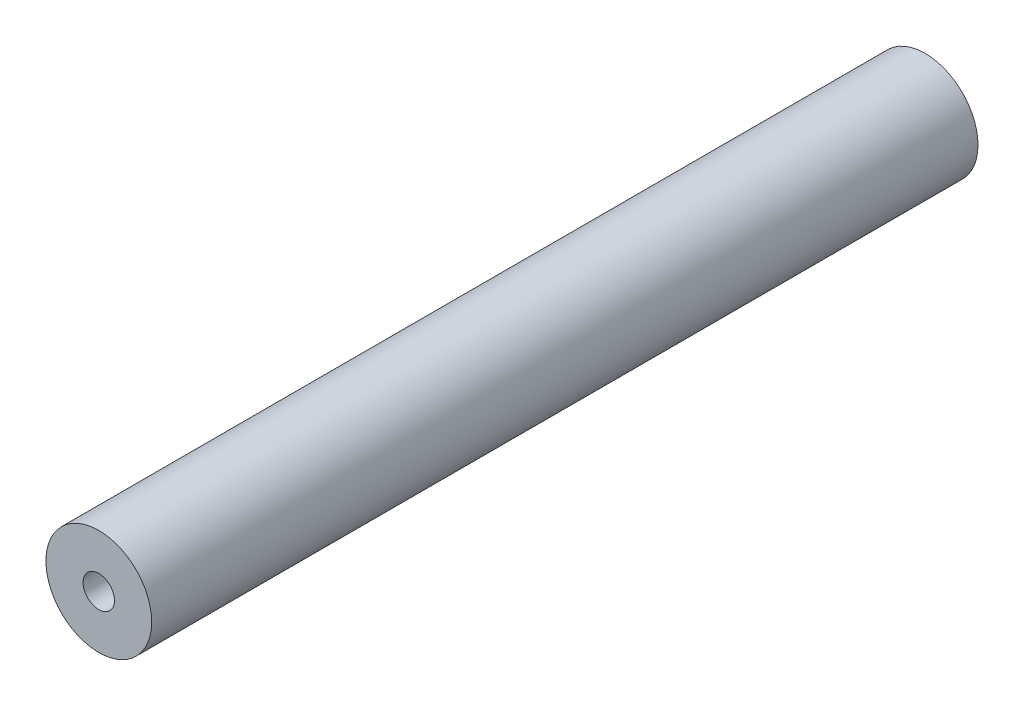
ISO-10303-21;
HEADER;
FILE_DESCRIPTION(('STEP AP214'),'2;1');
FILE_NAME('part.step','',(''),(''),'','','');
FILE_SCHEMA(('AUTOMOTIVE_DESIGN { 1 0 10303 214 1 1 1 1 }'));
ENDSEC;
DATA;
#1=APPLICATION_CONTEXT('core data for automotive mechanical design processes');
#2=APPLICATION_PROTOCOL_DEFINITION('international standard','automotive_design',2000,#1);
#3=PRODUCT_CONTEXT('',#1,'mechanical');
#4=PRODUCT('Part','Part','',(#3));
#5=PRODUCT_RELATED_PRODUCT_CATEGORY('part','',(#4));
#6=PRODUCT_DEFINITION_FORMATION('','',#4);
#7=PRODUCT_DEFINITION_CONTEXT('part definition',#1,'design');
#8=PRODUCT_DEFINITION('design','',#6,#7);
#9=PRODUCT_DEFINITION_SHAPE('','',#8);
#10=(LENGTH_UNIT() NAMED_UNIT(*) SI_UNIT(.MILLI.,.METRE.));
#11=(NAMED_UNIT(*) PLANE_ANGLE_UNIT() SI_UNIT($,.RADIAN.));
#12=(NAMED_UNIT(*) SI_UNIT($,.STERADIAN.) SOLID_ANGLE_UNIT());
#13=UNCERTAINTY_MEASURE_WITH_UNIT(LENGTH_MEASURE(1.E-05),#10,'distance_accuracy_value','');
#14=(GEOMETRIC_REPRESENTATION_CONTEXT(3) GLOBAL_UNCERTAINTY_ASSIGNED_CONTEXT((#13)) GLOBAL_UNIT_ASSIGNED_CONTEXT((#10,
#11,#12)) REPRESENTATION_CONTEXT('',''));
#15=CARTESIAN_POINT('',(0.,0.,0.));
#16=DIRECTION('',(0.,0.,1.));
#17=DIRECTION('',(1.,0.,0.));
#18=AXIS2_PLACEMENT_3D('',#15,#16,#17);
#19=CARTESIAN_POINT('',(0.,0.,100.));
#20=DIRECTION('',(0.,0.,-1.));
#21=DIRECTION('',(-1.,0.,0.));
#22=AXIS2_PLACEMENT_3D('',#19,#20,#21);
#23=CYLINDRICAL_SURFACE('',#22,6.4);
#24=CARTESIAN_POINT('',(0.,0.,100.));
#25=DIRECTION('',(0.,0.,1.));
#26=DIRECTION('',(1.,0.,0.));
#27=AXIS2_PLACEMENT_3D('',#24,#25,#26);
#28=CIRCLE('',#27,6.4);
#29=CARTESIAN_POINT('',(6.4,0.,100.));
#30=VERTEX_POINT('',#29);
#31=EDGE_CURVE('E11',#30,#30,#28,.T.);
#32=ORIENTED_EDGE('',*,*,#31,.F.);
#33=EDGE_LOOP('',(#32));
#34=FACE_BOUND('',#33,.T.);
#35=CARTESIAN_POINT('',(0.,0.,0.));
#36=DIRECTION('',(0.,0.,1.));
#37=DIRECTION('',(1.,0.,0.));
#38=AXIS2_PLACEMENT_3D('',#35,#36,#37);
#39=CIRCLE('',#38,6.4);
#40=CARTESIAN_POINT('',(6.4,0.,0.));
#41=VERTEX_POINT('',#40);
#42=EDGE_CURVE('E38',#41,#41,#39,.T.);
#43=ORIENTED_EDGE('',*,*,#42,.T.);
#44=EDGE_LOOP('',(#43));
#45=FACE_BOUND('',#44,.T.);
#46=ADVANCED_FACE('F35',(#34,#45),#23,.T.);
#47=CARTESIAN_POINT('',(0.,0.,100.));
#48=DIRECTION('',(0.,0.,1.));
#49=DIRECTION('',(1.,0.,0.));
#50=AXIS2_PLACEMENT_3D('',#47,#48,#49);
#51=PLANE('',#50);
#52=CARTESIAN_POINT('',(0.,0.,100.));
#53=DIRECTION('',(0.,0.,1.));
#54=DIRECTION('',(1.,0.,0.));
#55=AXIS2_PLACEMENT_3D('',#52,#53,#54);
#56=CIRCLE('',#55,1.89865);
#57=CARTESIAN_POINT('',(1.89865,0.,100.));
#58=VERTEX_POINT('',#57);
#59=EDGE_CURVE('E59',#58,#58,#56,.T.);
#60=ORIENTED_EDGE('',*,*,#59,.F.);
#61=EDGE_LOOP('',(#60));
#62=FACE_BOUND('',#61,.T.);
#63=ORIENTED_EDGE('',*,*,#31,.T.);
#64=EDGE_LOOP('',(#63));
#65=FACE_BOUND('',#64,.T.);
#66=ADVANCED_FACE('F77',(#62,#65),#51,.T.);
#67=CARTESIAN_POINT('',(0.,0.,0.));
#68=DIRECTION('',(0.,0.,1.));
#69=DIRECTION('',(1.,0.,0.));
#70=AXIS2_PLACEMENT_3D('',#67,#68,#69);
#71=PLANE('',#70);
#72=CARTESIAN_POINT('',(0.,0.,0.));
#73=DIRECTION('',(0.,0.,-1.));
#74=DIRECTION('',(-1.,0.,0.));
#75=AXIS2_PLACEMENT_3D('',#72,#73,#74);
#76=CIRCLE('',#75,1.89865);
#77=CARTESIAN_POINT('',(-1.89865,0.,0.));
#78=VERTEX_POINT('',#77);
#79=EDGE_CURVE('E58',#78,#78,#76,.T.);
#80=ORIENTED_EDGE('',*,*,#79,.F.);
#81=EDGE_LOOP('',(#80));
#82=FACE_BOUND('',#81,.T.);
#83=ORIENTED_EDGE('',*,*,#42,.F.);
#84=EDGE_LOOP('',(#83));
#85=FACE_BOUND('',#84,.T.);
#86=ADVANCED_FACE('F74',(#82,#85),#71,.F.);
#87=CARTESIAN_POINT('',(0.,0.,12.83));
#88=DIRECTION('',(0.,0.,-1.));
#89=DIRECTION('',(-1.,0.,0.));
#90=AXIS2_PLACEMENT_3D('',#87,#88,#89);
#91=CONICAL_SURFACE('',#90,1.89864999999999,1.02974425867665);
#92=CARTESIAN_POINT('',(0.,0.,13.9708240143167));
#93=VERTEX_POINT('',#92);
#94=VERTEX_LOOP('',#93);
#95=FACE_BOUND('',#94,.T.);
#96=CARTESIAN_POINT('',(0.,0.,12.83));
#97=DIRECTION('',(0.,0.,-1.));
#98=DIRECTION('',(-1.,0.,0.));
#99=AXIS2_PLACEMENT_3D('',#96,#97,#98);
#100=CIRCLE('',#99,1.89864999999999);
#101=CARTESIAN_POINT('',(-1.89864999999999,0.,12.83));
#102=VERTEX_POINT('',#101);
#103=EDGE_CURVE('E62',#102,#102,#100,.T.);
#104=ORIENTED_EDGE('',*,*,#103,.T.);
#105=EDGE_LOOP('',(#104));
#106=FACE_BOUND('',#105,.T.);
#107=ADVANCED_FACE('F76',(#95,#106),#91,.F.);
#108=CARTESIAN_POINT('',(0.,0.,0.));
#109=DIRECTION('',(0.,0.,-1.));
#110=DIRECTION('',(-1.,0.,0.));
#111=AXIS2_PLACEMENT_3D('',#108,#109,#110);
#112=CYLINDRICAL_SURFACE('',#111,1.89865);
#113=ORIENTED_EDGE('',*,*,#103,.F.);
#114=EDGE_LOOP('',(#113));
#115=FACE_BOUND('',#114,.T.);
#116=ORIENTED_EDGE('',*,*,#79,.T.);
#117=EDGE_LOOP('',(#116));
#118=FACE_BOUND('',#117,.T.);
#119=ADVANCED_FACE('F52',(#115,#118),#112,.F.);
#120=CARTESIAN_POINT('',(0.,0.,87.17));
#121=DIRECTION('',(0.,0.,1.));
#122=DIRECTION('',(1.,0.,0.));
#123=AXIS2_PLACEMENT_3D('',#120,#121,#122);
#124=CONICAL_SURFACE('',#123,1.89864999999999,1.02974425867665);
#125=CARTESIAN_POINT('',(0.,0.,86.0291759856833));
#126=VERTEX_POINT('',#125);
#127=VERTEX_LOOP('',#126);
#128=FACE_BOUND('',#127,.T.);
#129=CARTESIAN_POINT('',(0.,0.,87.17));
#130=DIRECTION('',(0.,0.,1.));
#131=DIRECTION('',(1.,0.,0.));
#132=AXIS2_PLACEMENT_3D('',#129,#130,#131);
#133=CIRCLE('',#132,1.89864999999999);
#134=CARTESIAN_POINT('',(1.89864999999999,0.,87.17));
#135=VERTEX_POINT('',#134);
#136=EDGE_CURVE('E56',#135,#135,#133,.T.);
#137=ORIENTED_EDGE('',*,*,#136,.T.);
#138=EDGE_LOOP('',(#137));
#139=FACE_BOUND('',#138,.T.);
#140=ADVANCED_FACE('F48',(#128,#139),#124,.F.);
#141=CARTESIAN_POINT('',(0.,0.,100.));
#142=DIRECTION('',(0.,0.,1.));
#143=DIRECTION('',(1.,0.,0.));
#144=AXIS2_PLACEMENT_3D('',#141,#142,#143);
#145=CYLINDRICAL_SURFACE('',#144,1.89865);
#146=ORIENTED_EDGE('',*,*,#136,.F.);
#147=EDGE_LOOP('',(#146));
#148=FACE_BOUND('',#147,.T.);
#149=ORIENTED_EDGE('',*,*,#59,.T.);
#150=EDGE_LOOP('',(#149));
#151=FACE_BOUND('',#150,.T.);
#152=ADVANCED_FACE('F51',(#148,#151),#145,.F.);
#153=CLOSED_SHELL('',(#46,#66,#86,#107,#119,#140,#152));
#154=MANIFOLD_SOLID_BREP('B2',#153);
#155=ADVANCED_BREP_SHAPE_REPRESENTATION('',(#18,#154),#14);
#156=SHAPE_DEFINITION_REPRESENTATION(#9,#155);
ENDSEC;
END-ISO-10303-21;
